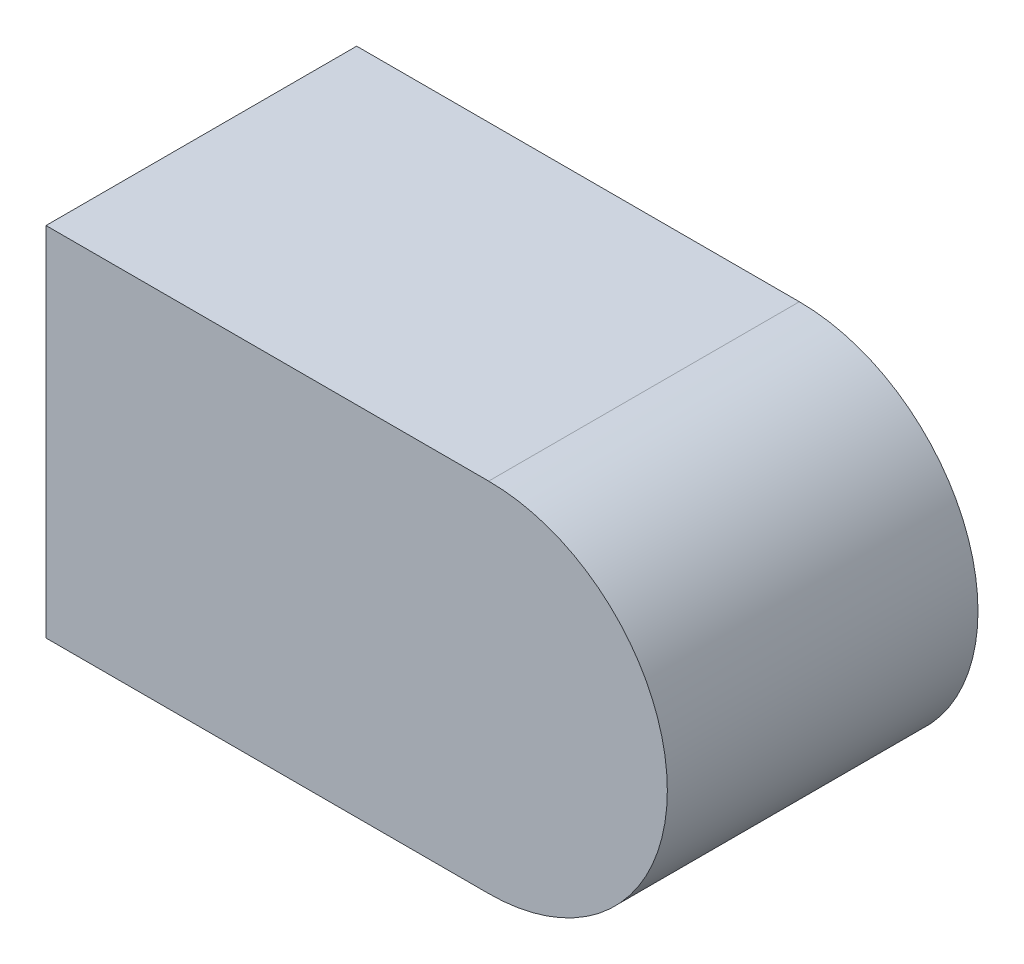
ISO-10303-21;
HEADER;
FILE_DESCRIPTION(('STEP AP214'),'2;1');
FILE_NAME('part.step','',(''),(''),'','','');
FILE_SCHEMA(('AUTOMOTIVE_DESIGN { 1 0 10303 214 1 1 1 1 }'));
ENDSEC;
DATA;
#1=APPLICATION_CONTEXT('core data for automotive mechanical design processes');
#2=APPLICATION_PROTOCOL_DEFINITION('international standard','automotive_design',2000,#1);
#3=PRODUCT_CONTEXT('',#1,'mechanical');
#4=PRODUCT('Part','Part','',(#3));
#5=PRODUCT_RELATED_PRODUCT_CATEGORY('part','',(#4));
#6=PRODUCT_DEFINITION_FORMATION('','',#4);
#7=PRODUCT_DEFINITION_CONTEXT('part definition',#1,'design');
#8=PRODUCT_DEFINITION('design','',#6,#7);
#9=PRODUCT_DEFINITION_SHAPE('','',#8);
#10=(LENGTH_UNIT() NAMED_UNIT(*) SI_UNIT(.MILLI.,.METRE.));
#11=(NAMED_UNIT(*) PLANE_ANGLE_UNIT() SI_UNIT($,.RADIAN.));
#12=(NAMED_UNIT(*) SI_UNIT($,.STERADIAN.) SOLID_ANGLE_UNIT());
#13=UNCERTAINTY_MEASURE_WITH_UNIT(LENGTH_MEASURE(1.E-05),#10,'distance_accuracy_value','');
#14=(GEOMETRIC_REPRESENTATION_CONTEXT(3) GLOBAL_UNCERTAINTY_ASSIGNED_CONTEXT((#13)) GLOBAL_UNIT_ASSIGNED_CONTEXT((#10,
#11,#12)) REPRESENTATION_CONTEXT('',''));
#15=CARTESIAN_POINT('',(0.,0.,0.));
#16=DIRECTION('',(0.,0.,1.));
#17=DIRECTION('',(1.,0.,0.));
#18=AXIS2_PLACEMENT_3D('',#15,#16,#17);
#19=CARTESIAN_POINT('',(-2.8335265642716,-1.25,0.));
#20=DIRECTION('',(0.,0.,1.));
#21=DIRECTION('',(1.,0.,0.));
#22=AXIS2_PLACEMENT_3D('',#19,#20,#21);
#23=PLANE('',#22);
#24=DIRECTION('',(0.,-1.,0.));
#25=VECTOR('',#24,1.);
#26=CARTESIAN_POINT('',(-3.,-1.135,0.));
#27=LINE('',#26,#25);
#28=CARTESIAN_POINT('',(-3.,-1.135,0.));
#29=VERTEX_POINT('',#28);
#30=CARTESIAN_POINT('',(-3.,-1.365,0.));
#31=VERTEX_POINT('',#30);
#32=EDGE_CURVE('E11',#29,#31,#27,.T.);
#33=ORIENTED_EDGE('',*,*,#32,.F.);
#34=DIRECTION('',(-1.,0.,0.));
#35=VECTOR('',#34,1.);
#36=CARTESIAN_POINT('',(-2.715,-1.135,0.));
#37=LINE('',#36,#35);
#38=CARTESIAN_POINT('',(-2.715,-1.135,0.));
#39=VERTEX_POINT('',#38);
#40=EDGE_CURVE('E24',#39,#29,#37,.T.);
#41=ORIENTED_EDGE('',*,*,#40,.F.);
#42=CARTESIAN_POINT('',(-2.715,-1.25,0.));
#43=DIRECTION('',(0.,0.,1.));
#44=DIRECTION('',(0.,-1.,0.));
#45=AXIS2_PLACEMENT_3D('',#42,#43,#44);
#46=CIRCLE('',#45,0.115);
#47=CARTESIAN_POINT('',(-2.715,-1.365,0.));
#48=VERTEX_POINT('',#47);
#49=EDGE_CURVE('E85',#48,#39,#46,.T.);
#50=ORIENTED_EDGE('',*,*,#49,.F.);
#51=DIRECTION('',(1.,0.,0.));
#52=VECTOR('',#51,1.);
#53=CARTESIAN_POINT('',(-3.,-1.365,0.));
#54=LINE('',#53,#52);
#55=EDGE_CURVE('E82',#31,#48,#54,.T.);
#56=ORIENTED_EDGE('',*,*,#55,.F.);
#57=EDGE_LOOP('',(#33,#41,#50,#56));
#58=FACE_BOUND('',#57,.T.);
#59=ADVANCED_FACE('F17',(#58),#23,.F.);
#60=CARTESIAN_POINT('',(-3.,-1.365,0.));
#61=DIRECTION('',(0.,-1.,0.));
#62=DIRECTION('',(1.,0.,0.));
#63=AXIS2_PLACEMENT_3D('',#60,#61,#62);
#64=PLANE('',#63);
#65=ORIENTED_EDGE('',*,*,#55,.T.);
#66=DIRECTION('',(0.,0.,1.));
#67=VECTOR('',#66,1.);
#68=CARTESIAN_POINT('',(-2.715,-1.365,0.));
#69=LINE('',#68,#67);
#70=CARTESIAN_POINT('',(-2.715,-1.365,0.2));
#71=VERTEX_POINT('',#70);
#72=EDGE_CURVE('E80',#48,#71,#69,.T.);
#73=ORIENTED_EDGE('',*,*,#72,.T.);
#74=DIRECTION('',(1.,0.,0.));
#75=VECTOR('',#74,1.);
#76=CARTESIAN_POINT('',(-3.,-1.365,0.2));
#77=LINE('',#76,#75);
#78=CARTESIAN_POINT('',(-3.,-1.365,0.2));
#79=VERTEX_POINT('',#78);
#80=EDGE_CURVE('E78',#79,#71,#77,.T.);
#81=ORIENTED_EDGE('',*,*,#80,.F.);
#82=DIRECTION('',(0.,0.,-1.));
#83=VECTOR('',#82,1.);
#84=CARTESIAN_POINT('',(-3.,-1.365,0.));
#85=LINE('',#84,#83);
#86=EDGE_CURVE('E71',#79,#31,#85,.T.);
#87=ORIENTED_EDGE('',*,*,#86,.T.);
#88=EDGE_LOOP('',(#65,#73,#81,#87));
#89=FACE_BOUND('',#88,.T.);
#90=ADVANCED_FACE('F91',(#89),#64,.T.);
#91=CARTESIAN_POINT('',(-2.715,-1.25,0.));
#92=DIRECTION('',(0.,0.,1.));
#93=DIRECTION('',(0.,-1.,0.));
#94=AXIS2_PLACEMENT_3D('',#91,#92,#93);
#95=CYLINDRICAL_SURFACE('',#94,0.115);
#96=ORIENTED_EDGE('',*,*,#49,.T.);
#97=DIRECTION('',(0.,0.,1.));
#98=VECTOR('',#97,1.);
#99=CARTESIAN_POINT('',(-2.715,-1.135,0.));
#100=LINE('',#99,#98);
#101=CARTESIAN_POINT('',(-2.715,-1.135,0.2));
#102=VERTEX_POINT('',#101);
#103=EDGE_CURVE('E75',#39,#102,#100,.T.);
#104=ORIENTED_EDGE('',*,*,#103,.T.);
#105=CARTESIAN_POINT('',(-2.715,-1.25,0.2));
#106=DIRECTION('',(0.,0.,1.));
#107=DIRECTION('',(0.,-1.,0.));
#108=AXIS2_PLACEMENT_3D('',#105,#106,#107);
#109=CIRCLE('',#108,0.115);
#110=EDGE_CURVE('E59',#71,#102,#109,.T.);
#111=ORIENTED_EDGE('',*,*,#110,.F.);
#112=ORIENTED_EDGE('',*,*,#72,.F.);
#113=EDGE_LOOP('',(#96,#104,#111,#112));
#114=FACE_BOUND('',#113,.T.);
#115=ADVANCED_FACE('F89',(#114),#95,.T.);
#116=CARTESIAN_POINT('',(-2.715,-1.135,0.));
#117=DIRECTION('',(0.,1.,0.));
#118=DIRECTION('',(-1.,0.,0.));
#119=AXIS2_PLACEMENT_3D('',#116,#117,#118);
#120=PLANE('',#119);
#121=ORIENTED_EDGE('',*,*,#40,.T.);
#122=DIRECTION('',(0.,0.,1.));
#123=VECTOR('',#122,1.);
#124=CARTESIAN_POINT('',(-3.,-1.135,0.));
#125=LINE('',#124,#123);
#126=CARTESIAN_POINT('',(-3.,-1.135,0.2));
#127=VERTEX_POINT('',#126);
#128=EDGE_CURVE('E53',#29,#127,#125,.T.);
#129=ORIENTED_EDGE('',*,*,#128,.T.);
#130=DIRECTION('',(-1.,0.,0.));
#131=VECTOR('',#130,1.);
#132=CARTESIAN_POINT('',(-2.715,-1.135,0.2));
#133=LINE('',#132,#131);
#134=EDGE_CURVE('E57',#102,#127,#133,.T.);
#135=ORIENTED_EDGE('',*,*,#134,.F.);
#136=ORIENTED_EDGE('',*,*,#103,.F.);
#137=EDGE_LOOP('',(#121,#129,#135,#136));
#138=FACE_BOUND('',#137,.T.);
#139=ADVANCED_FACE('F55',(#138),#120,.T.);
#140=CARTESIAN_POINT('',(-3.,3.,0.));
#141=DIRECTION('',(-1.,0.,0.));
#142=DIRECTION('',(0.,-1.,0.));
#143=AXIS2_PLACEMENT_3D('',#140,#141,#142);
#144=PLANE('',#143);
#145=ORIENTED_EDGE('',*,*,#86,.F.);
#146=DIRECTION('',(0.,-1.,0.));
#147=VECTOR('',#146,1.);
#148=CARTESIAN_POINT('',(-3.,0.875,0.2));
#149=LINE('',#148,#147);
#150=EDGE_CURVE('E66',#127,#79,#149,.T.);
#151=ORIENTED_EDGE('',*,*,#150,.F.);
#152=ORIENTED_EDGE('',*,*,#128,.F.);
#153=ORIENTED_EDGE('',*,*,#32,.T.);
#154=EDGE_LOOP('',(#145,#151,#152,#153));
#155=FACE_BOUND('',#154,.T.);
#156=ADVANCED_FACE('F69',(#155),#144,.T.);
#157=CARTESIAN_POINT('',(-2.8335240809167,-1.25,0.2));
#158=DIRECTION('',(0.,0.,1.));
#159=DIRECTION('',(1.,0.,0.));
#160=AXIS2_PLACEMENT_3D('',#157,#158,#159);
#161=PLANE('',#160);
#162=ORIENTED_EDGE('',*,*,#134,.T.);
#163=ORIENTED_EDGE('',*,*,#150,.T.);
#164=ORIENTED_EDGE('',*,*,#80,.T.);
#165=ORIENTED_EDGE('',*,*,#110,.T.);
#166=EDGE_LOOP('',(#162,#163,#164,#165));
#167=FACE_BOUND('',#166,.T.);
#168=ADVANCED_FACE('F64',(#167),#161,.T.);
#169=CLOSED_SHELL('',(#59,#90,#115,#139,#156,#168));
#170=MANIFOLD_SOLID_BREP('B1',#169);
#171=ADVANCED_BREP_SHAPE_REPRESENTATION('',(#18,#170),#14);
#172=SHAPE_DEFINITION_REPRESENTATION(#9,#171);
ENDSEC;
END-ISO-10303-21;
